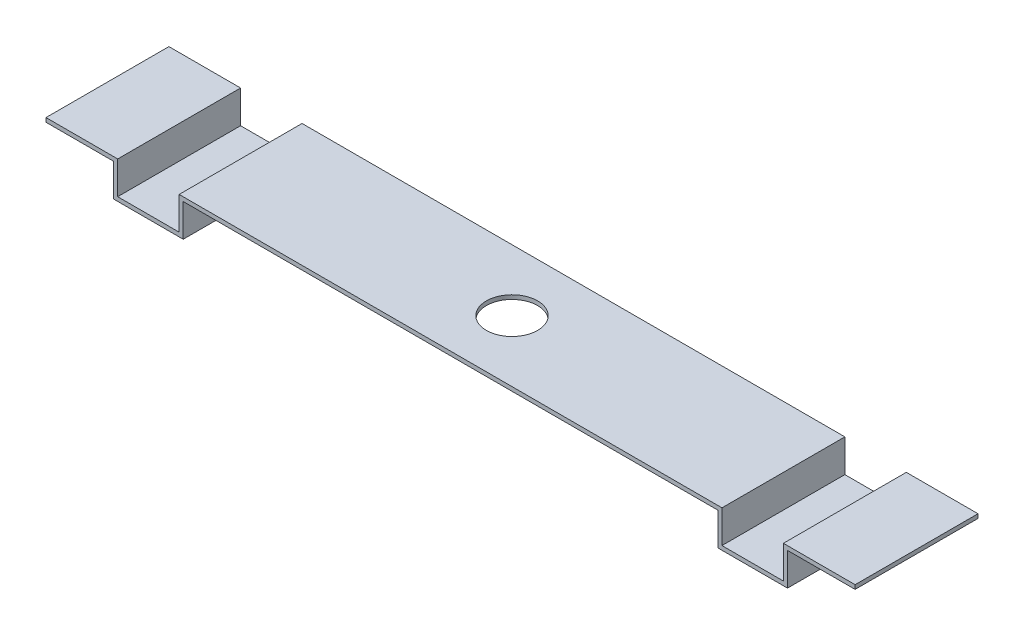
ISO-10303-21;
HEADER;
FILE_DESCRIPTION(('STEP AP214'),'2;1');
FILE_NAME('part.step','',(''),(''),'','','');
FILE_SCHEMA(('AUTOMOTIVE_DESIGN { 1 0 10303 214 1 1 1 1 }'));
ENDSEC;
DATA;
#1=APPLICATION_CONTEXT('core data for automotive mechanical design processes');
#2=APPLICATION_PROTOCOL_DEFINITION('international standard','automotive_design',2000,#1);
#3=PRODUCT_CONTEXT('',#1,'mechanical');
#4=PRODUCT('Part','Part','',(#3));
#5=PRODUCT_RELATED_PRODUCT_CATEGORY('part','',(#4));
#6=PRODUCT_DEFINITION_FORMATION('','',#4);
#7=PRODUCT_DEFINITION_CONTEXT('part definition',#1,'design');
#8=PRODUCT_DEFINITION('design','',#6,#7);
#9=PRODUCT_DEFINITION_SHAPE('','',#8);
#10=(LENGTH_UNIT() NAMED_UNIT(*) SI_UNIT(.MILLI.,.METRE.));
#11=(NAMED_UNIT(*) PLANE_ANGLE_UNIT() SI_UNIT($,.RADIAN.));
#12=(NAMED_UNIT(*) SI_UNIT($,.STERADIAN.) SOLID_ANGLE_UNIT());
#13=UNCERTAINTY_MEASURE_WITH_UNIT(LENGTH_MEASURE(1.E-05),#10,'distance_accuracy_value','');
#14=(GEOMETRIC_REPRESENTATION_CONTEXT(3) GLOBAL_UNCERTAINTY_ASSIGNED_CONTEXT((#13)) GLOBAL_UNIT_ASSIGNED_CONTEXT((#10,
#11,#12)) REPRESENTATION_CONTEXT('',''));
#15=CARTESIAN_POINT('',(0.,0.,0.));
#16=DIRECTION('',(0.,0.,1.));
#17=DIRECTION('',(1.,0.,0.));
#18=AXIS2_PLACEMENT_3D('',#15,#16,#17);
#19=CARTESIAN_POINT('',(305.142857142857,2.00000000000004,-60.));
#20=DIRECTION('',(1.,0.,0.));
#21=DIRECTION('',(0.,0.,-1.));
#22=AXIS2_PLACEMENT_3D('',#19,#20,#21);
#23=PLANE('',#22);
#24=DIRECTION('',(0.,1.,0.));
#25=VECTOR('',#24,1.);
#26=CARTESIAN_POINT('',(305.142857142857,2.00000000000004,0.));
#27=LINE('',#26,#25);
#28=CARTESIAN_POINT('',(305.142857142857,0.,0.));
#29=VERTEX_POINT('',#28);
#30=CARTESIAN_POINT('',(305.142857142857,2.00000000000004,0.));
#31=VERTEX_POINT('',#30);
#32=EDGE_CURVE('E215',#29,#31,#27,.T.);
#33=ORIENTED_EDGE('',*,*,#32,.F.);
#34=DIRECTION('',(0.,0.,1.));
#35=VECTOR('',#34,1.);
#36=CARTESIAN_POINT('',(305.142857142857,0.,-60.));
#37=LINE('',#36,#35);
#38=CARTESIAN_POINT('',(305.142857142857,0.,-60.));
#39=VERTEX_POINT('',#38);
#40=EDGE_CURVE('E11',#39,#29,#37,.T.);
#41=ORIENTED_EDGE('',*,*,#40,.F.);
#42=DIRECTION('',(0.,1.,0.));
#43=VECTOR('',#42,1.);
#44=CARTESIAN_POINT('',(305.142857142857,2.00000000000004,-60.));
#45=LINE('',#44,#43);
#46=CARTESIAN_POINT('',(305.142857142857,2.00000000000004,-60.));
#47=VERTEX_POINT('',#46);
#48=EDGE_CURVE('E291',#39,#47,#45,.T.);
#49=ORIENTED_EDGE('',*,*,#48,.T.);
#50=DIRECTION('',(0.,0.,1.));
#51=VECTOR('',#50,1.);
#52=CARTESIAN_POINT('',(305.142857142857,2.00000000000004,-60.));
#53=LINE('',#52,#51);
#54=EDGE_CURVE('E132',#47,#31,#53,.T.);
#55=ORIENTED_EDGE('',*,*,#54,.T.);
#56=EDGE_LOOP('',(#33,#41,#49,#55));
#57=FACE_BOUND('',#56,.T.);
#58=ADVANCED_FACE('F39',(#57),#23,.T.);
#59=CARTESIAN_POINT('',(305.142857142857,0.,-60.));
#60=DIRECTION('',(0.,-1.,0.));
#61=DIRECTION('',(1.,0.,0.));
#62=AXIS2_PLACEMENT_3D('',#59,#60,#61);
#63=PLANE('',#62);
#64=DIRECTION('',(1.,0.,0.));
#65=VECTOR('',#64,1.);
#66=CARTESIAN_POINT('',(305.142857142857,0.,0.));
#67=LINE('',#66,#65);
#68=CARTESIAN_POINT('',(272.142857142857,0.,0.));
#69=VERTEX_POINT('',#68);
#70=EDGE_CURVE('E288',#69,#29,#67,.T.);
#71=ORIENTED_EDGE('',*,*,#70,.F.);
#72=DIRECTION('',(0.,0.,1.));
#73=VECTOR('',#72,1.);
#74=CARTESIAN_POINT('',(272.142857142857,0.,-60.));
#75=LINE('',#74,#73);
#76=CARTESIAN_POINT('',(272.142857142857,0.,-60.));
#77=VERTEX_POINT('',#76);
#78=EDGE_CURVE('E49',#77,#69,#75,.T.);
#79=ORIENTED_EDGE('',*,*,#78,.F.);
#80=DIRECTION('',(1.,0.,0.));
#81=VECTOR('',#80,1.);
#82=CARTESIAN_POINT('',(305.142857142857,0.,-60.));
#83=LINE('',#82,#81);
#84=EDGE_CURVE('E201',#77,#39,#83,.T.);
#85=ORIENTED_EDGE('',*,*,#84,.T.);
#86=ORIENTED_EDGE('',*,*,#40,.T.);
#87=EDGE_LOOP('',(#71,#79,#85,#86));
#88=FACE_BOUND('',#87,.T.);
#89=ADVANCED_FACE('F346',(#88),#63,.T.);
#90=CARTESIAN_POINT('',(272.142857142857,0.,-60.));
#91=DIRECTION('',(1.,0.,0.));
#92=DIRECTION('',(0.,0.,-1.));
#93=AXIS2_PLACEMENT_3D('',#90,#91,#92);
#94=PLANE('',#93);
#95=DIRECTION('',(0.,1.,0.));
#96=VECTOR('',#95,1.);
#97=CARTESIAN_POINT('',(272.142857142857,0.,0.));
#98=LINE('',#97,#96);
#99=CARTESIAN_POINT('',(272.142857142857,-15.9642857142857,0.));
#100=VERTEX_POINT('',#99);
#101=EDGE_CURVE('E187',#100,#69,#98,.T.);
#102=ORIENTED_EDGE('',*,*,#101,.F.);
#103=DIRECTION('',(0.,0.,1.));
#104=VECTOR('',#103,1.);
#105=CARTESIAN_POINT('',(272.142857142857,-15.9642857142857,-60.));
#106=LINE('',#105,#104);
#107=CARTESIAN_POINT('',(272.142857142857,-15.9642857142857,-60.));
#108=VERTEX_POINT('',#107);
#109=EDGE_CURVE('E182',#108,#100,#106,.T.);
#110=ORIENTED_EDGE('',*,*,#109,.F.);
#111=DIRECTION('',(0.,1.,0.));
#112=VECTOR('',#111,1.);
#113=CARTESIAN_POINT('',(272.142857142857,0.,-60.));
#114=LINE('',#113,#112);
#115=EDGE_CURVE('E185',#108,#77,#114,.T.);
#116=ORIENTED_EDGE('',*,*,#115,.T.);
#117=ORIENTED_EDGE('',*,*,#78,.T.);
#118=EDGE_LOOP('',(#102,#110,#116,#117));
#119=FACE_BOUND('',#118,.T.);
#120=ADVANCED_FACE('F184',(#119),#94,.T.);
#121=CARTESIAN_POINT('',(272.142857142857,-15.9642857142857,-60.));
#122=DIRECTION('',(0.,-1.,0.));
#123=DIRECTION('',(1.,0.,0.));
#124=AXIS2_PLACEMENT_3D('',#121,#122,#123);
#125=PLANE('',#124);
#126=DIRECTION('',(1.,0.,0.));
#127=VECTOR('',#126,1.);
#128=CARTESIAN_POINT('',(272.142857142857,-15.9642857142857,0.));
#129=LINE('',#128,#127);
#130=CARTESIAN_POINT('',(238.142857142857,-15.9642857142857,0.));
#131=VERTEX_POINT('',#130);
#132=EDGE_CURVE('E283',#131,#100,#129,.T.);
#133=ORIENTED_EDGE('',*,*,#132,.F.);
#134=DIRECTION('',(0.,0.,1.));
#135=VECTOR('',#134,1.);
#136=CARTESIAN_POINT('',(238.142857142857,-15.9642857142857,-60.));
#137=LINE('',#136,#135);
#138=CARTESIAN_POINT('',(238.142857142857,-15.9642857142857,-60.));
#139=VERTEX_POINT('',#138);
#140=EDGE_CURVE('E193',#139,#131,#137,.T.);
#141=ORIENTED_EDGE('',*,*,#140,.F.);
#142=DIRECTION('',(1.,0.,0.));
#143=VECTOR('',#142,1.);
#144=CARTESIAN_POINT('',(272.142857142857,-15.9642857142857,-60.));
#145=LINE('',#144,#143);
#146=EDGE_CURVE('E199',#139,#108,#145,.T.);
#147=ORIENTED_EDGE('',*,*,#146,.T.);
#148=ORIENTED_EDGE('',*,*,#109,.T.);
#149=EDGE_LOOP('',(#133,#141,#147,#148));
#150=FACE_BOUND('',#149,.T.);
#151=ADVANCED_FACE('F204',(#150),#125,.T.);
#152=CARTESIAN_POINT('',(238.142857142857,-15.9642857142857,-60.));
#153=DIRECTION('',(-1.,0.,0.));
#154=DIRECTION('',(0.,0.,1.));
#155=AXIS2_PLACEMENT_3D('',#152,#153,#154);
#156=PLANE('',#155);
#157=DIRECTION('',(0.,-1.,0.));
#158=VECTOR('',#157,1.);
#159=CARTESIAN_POINT('',(238.142857142857,-15.9642857142857,0.));
#160=LINE('',#159,#158);
#161=CARTESIAN_POINT('',(238.142857142857,0.,0.));
#162=VERTEX_POINT('',#161);
#163=EDGE_CURVE('E279',#162,#131,#160,.T.);
#164=ORIENTED_EDGE('',*,*,#163,.F.);
#165=DIRECTION('',(0.,0.,1.));
#166=VECTOR('',#165,1.);
#167=CARTESIAN_POINT('',(238.142857142857,0.,-60.));
#168=LINE('',#167,#166);
#169=CARTESIAN_POINT('',(238.142857142857,0.,-60.));
#170=VERTEX_POINT('',#169);
#171=EDGE_CURVE('E297',#170,#162,#168,.T.);
#172=ORIENTED_EDGE('',*,*,#171,.F.);
#173=DIRECTION('',(0.,-1.,0.));
#174=VECTOR('',#173,1.);
#175=CARTESIAN_POINT('',(238.142857142857,-15.9642857142857,-60.));
#176=LINE('',#175,#174);
#177=EDGE_CURVE('E206',#170,#139,#176,.T.);
#178=ORIENTED_EDGE('',*,*,#177,.T.);
#179=ORIENTED_EDGE('',*,*,#140,.T.);
#180=EDGE_LOOP('',(#164,#172,#178,#179));
#181=FACE_BOUND('',#180,.T.);
#182=ADVANCED_FACE('F359',(#181),#156,.T.);
#183=CARTESIAN_POINT('',(238.142857142857,0.,-60.));
#184=DIRECTION('',(0.,-1.,0.));
#185=DIRECTION('',(1.,0.,0.));
#186=AXIS2_PLACEMENT_3D('',#183,#184,#185);
#187=PLANE('',#186);
#188=CARTESIAN_POINT('',(107.642857142857,0.,-30.));
#189=DIRECTION('',(0.,1.,0.));
#190=DIRECTION('',(0.,0.,1.));
#191=AXIS2_PLACEMENT_3D('',#188,#189,#190);
#192=CIRCLE('',#191,12.5);
#193=CARTESIAN_POINT('',(107.642857142857,0.,-17.5));
#194=VERTEX_POINT('',#193);
#195=EDGE_CURVE('E436',#194,#194,#192,.T.);
#196=ORIENTED_EDGE('',*,*,#195,.T.);
#197=EDGE_LOOP('',(#196));
#198=FACE_BOUND('',#197,.T.);
#199=DIRECTION('',(1.,0.,0.));
#200=VECTOR('',#199,1.);
#201=CARTESIAN_POINT('',(238.142857142857,0.,0.));
#202=LINE('',#201,#200);
#203=CARTESIAN_POINT('',(-22.8571428571429,0.,0.));
#204=VERTEX_POINT('',#203);
#205=EDGE_CURVE('E275',#204,#162,#202,.T.);
#206=ORIENTED_EDGE('',*,*,#205,.F.);
#207=DIRECTION('',(0.,0.,1.));
#208=VECTOR('',#207,1.);
#209=CARTESIAN_POINT('',(-22.8571428571429,0.,-60.));
#210=LINE('',#209,#208);
#211=CARTESIAN_POINT('',(-22.8571428571429,0.,-60.));
#212=VERTEX_POINT('',#211);
#213=EDGE_CURVE('E300',#212,#204,#210,.T.);
#214=ORIENTED_EDGE('',*,*,#213,.F.);
#215=DIRECTION('',(1.,0.,0.));
#216=VECTOR('',#215,1.);
#217=CARTESIAN_POINT('',(238.142857142857,0.,-60.));
#218=LINE('',#217,#216);
#219=EDGE_CURVE('E209',#212,#170,#218,.T.);
#220=ORIENTED_EDGE('',*,*,#219,.T.);
#221=ORIENTED_EDGE('',*,*,#171,.T.);
#222=EDGE_LOOP('',(#206,#214,#220,#221));
#223=FACE_BOUND('',#222,.T.);
#224=ADVANCED_FACE('F362',(#198,#223),#187,.T.);
#225=CARTESIAN_POINT('',(-22.8571428571429,0.,-60.));
#226=DIRECTION('',(1.,0.,0.));
#227=DIRECTION('',(0.,1.,0.));
#228=AXIS2_PLACEMENT_3D('',#225,#226,#227);
#229=PLANE('',#228);
#230=DIRECTION('',(0.,1.,0.));
#231=VECTOR('',#230,1.);
#232=CARTESIAN_POINT('',(-22.8571428571429,0.,0.));
#233=LINE('',#232,#231);
#234=CARTESIAN_POINT('',(-22.8571428571428,-15.9642857142857,0.));
#235=VERTEX_POINT('',#234);
#236=EDGE_CURVE('E271',#235,#204,#233,.T.);
#237=ORIENTED_EDGE('',*,*,#236,.F.);
#238=DIRECTION('',(0.,0.,1.));
#239=VECTOR('',#238,1.);
#240=CARTESIAN_POINT('',(-22.8571428571428,-15.9642857142857,-60.));
#241=LINE('',#240,#239);
#242=CARTESIAN_POINT('',(-22.8571428571428,-15.9642857142857,-60.));
#243=VERTEX_POINT('',#242);
#244=EDGE_CURVE('E303',#243,#235,#241,.T.);
#245=ORIENTED_EDGE('',*,*,#244,.F.);
#246=DIRECTION('',(0.,1.,0.));
#247=VECTOR('',#246,1.);
#248=CARTESIAN_POINT('',(-22.8571428571429,0.,-60.));
#249=LINE('',#248,#247);
#250=EDGE_CURVE('E494',#243,#212,#249,.T.);
#251=ORIENTED_EDGE('',*,*,#250,.T.);
#252=ORIENTED_EDGE('',*,*,#213,.T.);
#253=EDGE_LOOP('',(#237,#245,#251,#252));
#254=FACE_BOUND('',#253,.T.);
#255=ADVANCED_FACE('F366',(#254),#229,.T.);
#256=CARTESIAN_POINT('',(-22.8571428571428,-15.9642857142857,-60.));
#257=DIRECTION('',(0.,-1.,0.));
#258=DIRECTION('',(0.,0.,-1.));
#259=AXIS2_PLACEMENT_3D('',#256,#257,#258);
#260=PLANE('',#259);
#261=DIRECTION('',(1.,0.,0.));
#262=VECTOR('',#261,1.);
#263=CARTESIAN_POINT('',(-22.8571428571428,-15.9642857142857,0.));
#264=LINE('',#263,#262);
#265=CARTESIAN_POINT('',(-56.8571428571428,-15.9642857142857,0.));
#266=VERTEX_POINT('',#265);
#267=EDGE_CURVE('E267',#266,#235,#264,.T.);
#268=ORIENTED_EDGE('',*,*,#267,.F.);
#269=DIRECTION('',(0.,0.,1.));
#270=VECTOR('',#269,1.);
#271=CARTESIAN_POINT('',(-56.8571428571428,-15.9642857142857,-60.));
#272=LINE('',#271,#270);
#273=CARTESIAN_POINT('',(-56.8571428571428,-15.9642857142857,-60.));
#274=VERTEX_POINT('',#273);
#275=EDGE_CURVE('E306',#274,#266,#272,.T.);
#276=ORIENTED_EDGE('',*,*,#275,.F.);
#277=DIRECTION('',(1.,0.,0.));
#278=VECTOR('',#277,1.);
#279=CARTESIAN_POINT('',(-22.8571428571428,-15.9642857142857,-60.));
#280=LINE('',#279,#278);
#281=EDGE_CURVE('E490',#274,#243,#280,.T.);
#282=ORIENTED_EDGE('',*,*,#281,.T.);
#283=ORIENTED_EDGE('',*,*,#244,.T.);
#284=EDGE_LOOP('',(#268,#276,#282,#283));
#285=FACE_BOUND('',#284,.T.);
#286=ADVANCED_FACE('F370',(#285),#260,.T.);
#287=CARTESIAN_POINT('',(-56.8571428571428,-15.9642857142857,-60.));
#288=DIRECTION('',(-1.,0.,0.));
#289=DIRECTION('',(0.,0.,1.));
#290=AXIS2_PLACEMENT_3D('',#287,#288,#289);
#291=PLANE('',#290);
#292=DIRECTION('',(0.,-1.,0.));
#293=VECTOR('',#292,1.);
#294=CARTESIAN_POINT('',(-56.8571428571428,-15.9642857142857,0.));
#295=LINE('',#294,#293);
#296=CARTESIAN_POINT('',(-56.8571428571428,0.,0.));
#297=VERTEX_POINT('',#296);
#298=EDGE_CURVE('E263',#297,#266,#295,.T.);
#299=ORIENTED_EDGE('',*,*,#298,.F.);
#300=DIRECTION('',(0.,0.,1.));
#301=VECTOR('',#300,1.);
#302=CARTESIAN_POINT('',(-56.8571428571428,0.,-60.));
#303=LINE('',#302,#301);
#304=CARTESIAN_POINT('',(-56.8571428571428,0.,-60.));
#305=VERTEX_POINT('',#304);
#306=EDGE_CURVE('E309',#305,#297,#303,.T.);
#307=ORIENTED_EDGE('',*,*,#306,.F.);
#308=DIRECTION('',(0.,-1.,0.));
#309=VECTOR('',#308,1.);
#310=CARTESIAN_POINT('',(-56.8571428571428,-15.9642857142857,-60.));
#311=LINE('',#310,#309);
#312=EDGE_CURVE('E486',#305,#274,#311,.T.);
#313=ORIENTED_EDGE('',*,*,#312,.T.);
#314=ORIENTED_EDGE('',*,*,#275,.T.);
#315=EDGE_LOOP('',(#299,#307,#313,#314));
#316=FACE_BOUND('',#315,.T.);
#317=ADVANCED_FACE('F374',(#316),#291,.T.);
#318=CARTESIAN_POINT('',(-56.8571428571428,0.,-60.));
#319=DIRECTION('',(0.,-1.,0.));
#320=DIRECTION('',(1.,0.,0.));
#321=AXIS2_PLACEMENT_3D('',#318,#319,#320);
#322=PLANE('',#321);
#323=DIRECTION('',(1.,0.,0.));
#324=VECTOR('',#323,1.);
#325=CARTESIAN_POINT('',(-56.8571428571428,0.,0.));
#326=LINE('',#325,#324);
#327=CARTESIAN_POINT('',(-89.8571428571428,0.,0.));
#328=VERTEX_POINT('',#327);
#329=EDGE_CURVE('E259',#328,#297,#326,.T.);
#330=ORIENTED_EDGE('',*,*,#329,.F.);
#331=DIRECTION('',(0.,0.,1.));
#332=VECTOR('',#331,1.);
#333=CARTESIAN_POINT('',(-89.8571428571428,0.,-60.));
#334=LINE('',#333,#332);
#335=CARTESIAN_POINT('',(-89.8571428571428,0.,-60.));
#336=VERTEX_POINT('',#335);
#337=EDGE_CURVE('E312',#336,#328,#334,.T.);
#338=ORIENTED_EDGE('',*,*,#337,.F.);
#339=DIRECTION('',(1.,0.,0.));
#340=VECTOR('',#339,1.);
#341=CARTESIAN_POINT('',(-56.8571428571428,0.,-60.));
#342=LINE('',#341,#340);
#343=EDGE_CURVE('E482',#336,#305,#342,.T.);
#344=ORIENTED_EDGE('',*,*,#343,.T.);
#345=ORIENTED_EDGE('',*,*,#306,.T.);
#346=EDGE_LOOP('',(#330,#338,#344,#345));
#347=FACE_BOUND('',#346,.T.);
#348=ADVANCED_FACE('F378',(#347),#322,.T.);
#349=CARTESIAN_POINT('',(-89.8571428571428,2.,-60.));
#350=DIRECTION('',(-1.,0.,0.));
#351=DIRECTION('',(0.,-1.,0.));
#352=AXIS2_PLACEMENT_3D('',#349,#350,#351);
#353=PLANE('',#352);
#354=DIRECTION('',(0.,-1.,0.));
#355=VECTOR('',#354,1.);
#356=CARTESIAN_POINT('',(-89.8571428571428,2.,0.));
#357=LINE('',#356,#355);
#358=CARTESIAN_POINT('',(-89.8571428571428,2.,0.));
#359=VERTEX_POINT('',#358);
#360=EDGE_CURVE('E255',#359,#328,#357,.T.);
#361=ORIENTED_EDGE('',*,*,#360,.F.);
#362=DIRECTION('',(0.,0.,1.));
#363=VECTOR('',#362,1.);
#364=CARTESIAN_POINT('',(-89.8571428571428,2.,-60.));
#365=LINE('',#364,#363);
#366=CARTESIAN_POINT('',(-89.8571428571428,2.,-60.));
#367=VERTEX_POINT('',#366);
#368=EDGE_CURVE('E315',#367,#359,#365,.T.);
#369=ORIENTED_EDGE('',*,*,#368,.F.);
#370=DIRECTION('',(0.,-1.,0.));
#371=VECTOR('',#370,1.);
#372=CARTESIAN_POINT('',(-89.8571428571428,2.,-60.));
#373=LINE('',#372,#371);
#374=EDGE_CURVE('E478',#367,#336,#373,.T.);
#375=ORIENTED_EDGE('',*,*,#374,.T.);
#376=ORIENTED_EDGE('',*,*,#337,.T.);
#377=EDGE_LOOP('',(#361,#369,#375,#376));
#378=FACE_BOUND('',#377,.T.);
#379=ADVANCED_FACE('F382',(#378),#353,.T.);
#380=CARTESIAN_POINT('',(-89.8571428571428,2.,-60.));
#381=DIRECTION('',(0.,1.,0.));
#382=DIRECTION('',(0.,0.,1.));
#383=AXIS2_PLACEMENT_3D('',#380,#381,#382);
#384=PLANE('',#383);
#385=DIRECTION('',(-1.,0.,0.));
#386=VECTOR('',#385,1.);
#387=CARTESIAN_POINT('',(-89.8571428571428,2.,0.));
#388=LINE('',#387,#386);
#389=CARTESIAN_POINT('',(-54.8571428571428,2.,0.));
#390=VERTEX_POINT('',#389);
#391=EDGE_CURVE('E251',#390,#359,#388,.T.);
#392=ORIENTED_EDGE('',*,*,#391,.F.);
#393=DIRECTION('',(0.,0.,1.));
#394=VECTOR('',#393,1.);
#395=CARTESIAN_POINT('',(-54.8571428571428,2.,-60.));
#396=LINE('',#395,#394);
#397=CARTESIAN_POINT('',(-54.8571428571428,2.,-60.));
#398=VERTEX_POINT('',#397);
#399=EDGE_CURVE('E318',#398,#390,#396,.T.);
#400=ORIENTED_EDGE('',*,*,#399,.F.);
#401=DIRECTION('',(-1.,0.,0.));
#402=VECTOR('',#401,1.);
#403=CARTESIAN_POINT('',(-89.8571428571428,2.,-60.));
#404=LINE('',#403,#402);
#405=EDGE_CURVE('E474',#398,#367,#404,.T.);
#406=ORIENTED_EDGE('',*,*,#405,.T.);
#407=ORIENTED_EDGE('',*,*,#368,.T.);
#408=EDGE_LOOP('',(#392,#400,#406,#407));
#409=FACE_BOUND('',#408,.T.);
#410=ADVANCED_FACE('F386',(#409),#384,.T.);
#411=CARTESIAN_POINT('',(-54.8571428571428,2.,-60.));
#412=DIRECTION('',(1.,0.,0.));
#413=DIRECTION('',(0.,0.,-1.));
#414=AXIS2_PLACEMENT_3D('',#411,#412,#413);
#415=PLANE('',#414);
#416=DIRECTION('',(0.,1.,0.));
#417=VECTOR('',#416,1.);
#418=CARTESIAN_POINT('',(-54.8571428571428,2.,0.));
#419=LINE('',#418,#417);
#420=CARTESIAN_POINT('',(-54.8571428571428,-13.9642857142857,0.));
#421=VERTEX_POINT('',#420);
#422=EDGE_CURVE('E247',#421,#390,#419,.T.);
#423=ORIENTED_EDGE('',*,*,#422,.F.);
#424=DIRECTION('',(0.,0.,1.));
#425=VECTOR('',#424,1.);
#426=CARTESIAN_POINT('',(-54.8571428571428,-13.9642857142857,-60.));
#427=LINE('',#426,#425);
#428=CARTESIAN_POINT('',(-54.8571428571428,-13.9642857142857,-60.));
#429=VERTEX_POINT('',#428);
#430=EDGE_CURVE('E321',#429,#421,#427,.T.);
#431=ORIENTED_EDGE('',*,*,#430,.F.);
#432=DIRECTION('',(0.,1.,0.));
#433=VECTOR('',#432,1.);
#434=CARTESIAN_POINT('',(-54.8571428571428,2.,-60.));
#435=LINE('',#434,#433);
#436=EDGE_CURVE('E470',#429,#398,#435,.T.);
#437=ORIENTED_EDGE('',*,*,#436,.T.);
#438=ORIENTED_EDGE('',*,*,#399,.T.);
#439=EDGE_LOOP('',(#423,#431,#437,#438));
#440=FACE_BOUND('',#439,.T.);
#441=ADVANCED_FACE('F390',(#440),#415,.T.);
#442=CARTESIAN_POINT('',(-54.8571428571428,-13.9642857142857,-60.));
#443=DIRECTION('',(0.,1.,0.));
#444=DIRECTION('',(-1.,0.,0.));
#445=AXIS2_PLACEMENT_3D('',#442,#443,#444);
#446=PLANE('',#445);
#447=DIRECTION('',(-1.,0.,0.));
#448=VECTOR('',#447,1.);
#449=CARTESIAN_POINT('',(-54.8571428571428,-13.9642857142857,0.));
#450=LINE('',#449,#448);
#451=CARTESIAN_POINT('',(-24.8571428571428,-13.9642857142857,0.));
#452=VERTEX_POINT('',#451);
#453=EDGE_CURVE('E243',#452,#421,#450,.T.);
#454=ORIENTED_EDGE('',*,*,#453,.F.);
#455=DIRECTION('',(0.,0.,1.));
#456=VECTOR('',#455,1.);
#457=CARTESIAN_POINT('',(-24.8571428571428,-13.9642857142857,-60.));
#458=LINE('',#457,#456);
#459=CARTESIAN_POINT('',(-24.8571428571428,-13.9642857142857,-60.));
#460=VERTEX_POINT('',#459);
#461=EDGE_CURVE('E324',#460,#452,#458,.T.);
#462=ORIENTED_EDGE('',*,*,#461,.F.);
#463=DIRECTION('',(-1.,0.,0.));
#464=VECTOR('',#463,1.);
#465=CARTESIAN_POINT('',(-54.8571428571428,-13.9642857142857,-60.));
#466=LINE('',#465,#464);
#467=EDGE_CURVE('E466',#460,#429,#466,.T.);
#468=ORIENTED_EDGE('',*,*,#467,.T.);
#469=ORIENTED_EDGE('',*,*,#430,.T.);
#470=EDGE_LOOP('',(#454,#462,#468,#469));
#471=FACE_BOUND('',#470,.T.);
#472=ADVANCED_FACE('F394',(#471),#446,.T.);
#473=CARTESIAN_POINT('',(-24.8571428571428,-13.9642857142857,-60.));
#474=DIRECTION('',(-1.,0.,0.));
#475=DIRECTION('',(0.,-1.,0.));
#476=AXIS2_PLACEMENT_3D('',#473,#474,#475);
#477=PLANE('',#476);
#478=DIRECTION('',(0.,-1.,0.));
#479=VECTOR('',#478,1.);
#480=CARTESIAN_POINT('',(-24.8571428571428,-13.9642857142857,0.));
#481=LINE('',#480,#479);
#482=CARTESIAN_POINT('',(-24.8571428571428,1.99999999999999,0.));
#483=VERTEX_POINT('',#482);
#484=EDGE_CURVE('E239',#483,#452,#481,.T.);
#485=ORIENTED_EDGE('',*,*,#484,.F.);
#486=DIRECTION('',(0.,0.,1.));
#487=VECTOR('',#486,1.);
#488=CARTESIAN_POINT('',(-24.8571428571428,1.99999999999999,-60.));
#489=LINE('',#488,#487);
#490=CARTESIAN_POINT('',(-24.8571428571428,1.99999999999999,-60.));
#491=VERTEX_POINT('',#490);
#492=EDGE_CURVE('E327',#491,#483,#489,.T.);
#493=ORIENTED_EDGE('',*,*,#492,.F.);
#494=DIRECTION('',(0.,-1.,0.));
#495=VECTOR('',#494,1.);
#496=CARTESIAN_POINT('',(-24.8571428571428,-13.9642857142857,-60.));
#497=LINE('',#496,#495);
#498=EDGE_CURVE('E462',#491,#460,#497,.T.);
#499=ORIENTED_EDGE('',*,*,#498,.T.);
#500=ORIENTED_EDGE('',*,*,#461,.T.);
#501=EDGE_LOOP('',(#485,#493,#499,#500));
#502=FACE_BOUND('',#501,.T.);
#503=ADVANCED_FACE('F398',(#502),#477,.T.);
#504=CARTESIAN_POINT('',(-24.8571428571428,1.99999999999999,-60.));
#505=DIRECTION('',(0.,1.,0.));
#506=DIRECTION('',(0.,0.,1.));
#507=AXIS2_PLACEMENT_3D('',#504,#505,#506);
#508=PLANE('',#507);
#509=CARTESIAN_POINT('',(107.642857142857,1.99999999999999,-30.));
#510=DIRECTION('',(0.,1.,0.));
#511=DIRECTION('',(0.,0.,1.));
#512=AXIS2_PLACEMENT_3D('',#509,#510,#511);
#513=CIRCLE('',#512,12.5);
#514=CARTESIAN_POINT('',(107.642857142857,1.99999999999999,-17.5));
#515=VERTEX_POINT('',#514);
#516=EDGE_CURVE('E42',#515,#515,#513,.F.);
#517=ORIENTED_EDGE('',*,*,#516,.T.);
#518=EDGE_LOOP('',(#517));
#519=FACE_BOUND('',#518,.T.);
#520=DIRECTION('',(-1.,0.,0.));
#521=VECTOR('',#520,1.);
#522=CARTESIAN_POINT('',(-24.8571428571428,1.99999999999999,0.));
#523=LINE('',#522,#521);
#524=CARTESIAN_POINT('',(240.142857142857,1.99999999999999,0.));
#525=VERTEX_POINT('',#524);
#526=EDGE_CURVE('E235',#525,#483,#523,.T.);
#527=ORIENTED_EDGE('',*,*,#526,.F.);
#528=DIRECTION('',(0.,0.,1.));
#529=VECTOR('',#528,1.);
#530=CARTESIAN_POINT('',(240.142857142857,1.99999999999999,-60.));
#531=LINE('',#530,#529);
#532=CARTESIAN_POINT('',(240.142857142857,1.99999999999999,-60.));
#533=VERTEX_POINT('',#532);
#534=EDGE_CURVE('E330',#533,#525,#531,.T.);
#535=ORIENTED_EDGE('',*,*,#534,.F.);
#536=DIRECTION('',(-1.,0.,0.));
#537=VECTOR('',#536,1.);
#538=CARTESIAN_POINT('',(-24.8571428571428,1.99999999999999,-60.));
#539=LINE('',#538,#537);
#540=EDGE_CURVE('E458',#533,#491,#539,.T.);
#541=ORIENTED_EDGE('',*,*,#540,.T.);
#542=ORIENTED_EDGE('',*,*,#492,.T.);
#543=EDGE_LOOP('',(#527,#535,#541,#542));
#544=FACE_BOUND('',#543,.T.);
#545=ADVANCED_FACE('F402',(#519,#544),#508,.T.);
#546=CARTESIAN_POINT('',(240.142857142857,1.99999999999999,-60.));
#547=DIRECTION('',(1.,0.,0.));
#548=DIRECTION('',(0.,0.,-1.));
#549=AXIS2_PLACEMENT_3D('',#546,#547,#548);
#550=PLANE('',#549);
#551=DIRECTION('',(0.,1.,0.));
#552=VECTOR('',#551,1.);
#553=CARTESIAN_POINT('',(240.142857142857,1.99999999999999,0.));
#554=LINE('',#553,#552);
#555=CARTESIAN_POINT('',(240.142857142857,-13.9642857142857,0.));
#556=VERTEX_POINT('',#555);
#557=EDGE_CURVE('E231',#556,#525,#554,.T.);
#558=ORIENTED_EDGE('',*,*,#557,.F.);
#559=DIRECTION('',(0.,0.,1.));
#560=VECTOR('',#559,1.);
#561=CARTESIAN_POINT('',(240.142857142857,-13.9642857142857,-60.));
#562=LINE('',#561,#560);
#563=CARTESIAN_POINT('',(240.142857142857,-13.9642857142857,-60.));
#564=VERTEX_POINT('',#563);
#565=EDGE_CURVE('E333',#564,#556,#562,.T.);
#566=ORIENTED_EDGE('',*,*,#565,.F.);
#567=DIRECTION('',(0.,1.,0.));
#568=VECTOR('',#567,1.);
#569=CARTESIAN_POINT('',(240.142857142857,1.99999999999999,-60.));
#570=LINE('',#569,#568);
#571=EDGE_CURVE('E454',#564,#533,#570,.T.);
#572=ORIENTED_EDGE('',*,*,#571,.T.);
#573=ORIENTED_EDGE('',*,*,#534,.T.);
#574=EDGE_LOOP('',(#558,#566,#572,#573));
#575=FACE_BOUND('',#574,.T.);
#576=ADVANCED_FACE('F406',(#575),#550,.T.);
#577=CARTESIAN_POINT('',(240.142857142857,-13.9642857142857,-60.));
#578=DIRECTION('',(0.,1.,0.));
#579=DIRECTION('',(-1.,0.,0.));
#580=AXIS2_PLACEMENT_3D('',#577,#578,#579);
#581=PLANE('',#580);
#582=DIRECTION('',(-1.,0.,0.));
#583=VECTOR('',#582,1.);
#584=CARTESIAN_POINT('',(240.142857142857,-13.9642857142857,0.));
#585=LINE('',#584,#583);
#586=CARTESIAN_POINT('',(270.142857142857,-13.9642857142857,0.));
#587=VERTEX_POINT('',#586);
#588=EDGE_CURVE('E227',#587,#556,#585,.T.);
#589=ORIENTED_EDGE('',*,*,#588,.F.);
#590=DIRECTION('',(0.,0.,1.));
#591=VECTOR('',#590,1.);
#592=CARTESIAN_POINT('',(270.142857142857,-13.9642857142857,-60.));
#593=LINE('',#592,#591);
#594=CARTESIAN_POINT('',(270.142857142857,-13.9642857142857,-60.));
#595=VERTEX_POINT('',#594);
#596=EDGE_CURVE('E336',#595,#587,#593,.T.);
#597=ORIENTED_EDGE('',*,*,#596,.F.);
#598=DIRECTION('',(-1.,0.,0.));
#599=VECTOR('',#598,1.);
#600=CARTESIAN_POINT('',(240.142857142857,-13.9642857142857,-60.));
#601=LINE('',#600,#599);
#602=EDGE_CURVE('E450',#595,#564,#601,.T.);
#603=ORIENTED_EDGE('',*,*,#602,.T.);
#604=ORIENTED_EDGE('',*,*,#565,.T.);
#605=EDGE_LOOP('',(#589,#597,#603,#604));
#606=FACE_BOUND('',#605,.T.);
#607=ADVANCED_FACE('F410',(#606),#581,.T.);
#608=CARTESIAN_POINT('',(270.142857142857,-13.9642857142857,-60.));
#609=DIRECTION('',(-1.,0.,0.));
#610=DIRECTION('',(0.,0.,1.));
#611=AXIS2_PLACEMENT_3D('',#608,#609,#610);
#612=PLANE('',#611);
#613=DIRECTION('',(0.,-1.,0.));
#614=VECTOR('',#613,1.);
#615=CARTESIAN_POINT('',(270.142857142857,-13.9642857142857,0.));
#616=LINE('',#615,#614);
#617=CARTESIAN_POINT('',(270.142857142857,2.00000000000004,0.));
#618=VERTEX_POINT('',#617);
#619=EDGE_CURVE('E223',#618,#587,#616,.T.);
#620=ORIENTED_EDGE('',*,*,#619,.F.);
#621=DIRECTION('',(0.,0.,1.));
#622=VECTOR('',#621,1.);
#623=CARTESIAN_POINT('',(270.142857142857,2.00000000000004,-60.));
#624=LINE('',#623,#622);
#625=CARTESIAN_POINT('',(270.142857142857,2.00000000000004,-60.));
#626=VERTEX_POINT('',#625);
#627=EDGE_CURVE('E339',#626,#618,#624,.T.);
#628=ORIENTED_EDGE('',*,*,#627,.F.);
#629=DIRECTION('',(0.,-1.,0.));
#630=VECTOR('',#629,1.);
#631=CARTESIAN_POINT('',(270.142857142857,-13.9642857142857,-60.));
#632=LINE('',#631,#630);
#633=EDGE_CURVE('E446',#626,#595,#632,.T.);
#634=ORIENTED_EDGE('',*,*,#633,.T.);
#635=ORIENTED_EDGE('',*,*,#596,.T.);
#636=EDGE_LOOP('',(#620,#628,#634,#635));
#637=FACE_BOUND('',#636,.T.);
#638=ADVANCED_FACE('F414',(#637),#612,.T.);
#639=CARTESIAN_POINT('',(270.142857142857,2.00000000000004,-60.));
#640=DIRECTION('',(0.,1.,0.));
#641=DIRECTION('',(-1.,0.,0.));
#642=AXIS2_PLACEMENT_3D('',#639,#640,#641);
#643=PLANE('',#642);
#644=DIRECTION('',(-1.,0.,0.));
#645=VECTOR('',#644,1.);
#646=CARTESIAN_POINT('',(270.142857142857,2.00000000000004,0.));
#647=LINE('',#646,#645);
#648=EDGE_CURVE('E219',#31,#618,#647,.T.);
#649=ORIENTED_EDGE('',*,*,#648,.F.);
#650=ORIENTED_EDGE('',*,*,#54,.F.);
#651=DIRECTION('',(-1.,0.,0.));
#652=VECTOR('',#651,1.);
#653=CARTESIAN_POINT('',(270.142857142857,2.00000000000004,-60.));
#654=LINE('',#653,#652);
#655=EDGE_CURVE('E443',#47,#626,#654,.T.);
#656=ORIENTED_EDGE('',*,*,#655,.T.);
#657=ORIENTED_EDGE('',*,*,#627,.T.);
#658=EDGE_LOOP('',(#649,#650,#656,#657));
#659=FACE_BOUND('',#658,.T.);
#660=ADVANCED_FACE('F342',(#659),#643,.T.);
#661=CARTESIAN_POINT('',(0.,0.,-60.));
#662=DIRECTION('',(0.,0.,-1.));
#663=DIRECTION('',(-1.,0.,0.));
#664=AXIS2_PLACEMENT_3D('',#661,#662,#663);
#665=PLANE('',#664);
#666=ORIENTED_EDGE('',*,*,#48,.F.);
#667=ORIENTED_EDGE('',*,*,#84,.F.);
#668=ORIENTED_EDGE('',*,*,#115,.F.);
#669=ORIENTED_EDGE('',*,*,#146,.F.);
#670=ORIENTED_EDGE('',*,*,#177,.F.);
#671=ORIENTED_EDGE('',*,*,#219,.F.);
#672=ORIENTED_EDGE('',*,*,#250,.F.);
#673=ORIENTED_EDGE('',*,*,#281,.F.);
#674=ORIENTED_EDGE('',*,*,#312,.F.);
#675=ORIENTED_EDGE('',*,*,#343,.F.);
#676=ORIENTED_EDGE('',*,*,#374,.F.);
#677=ORIENTED_EDGE('',*,*,#405,.F.);
#678=ORIENTED_EDGE('',*,*,#436,.F.);
#679=ORIENTED_EDGE('',*,*,#467,.F.);
#680=ORIENTED_EDGE('',*,*,#498,.F.);
#681=ORIENTED_EDGE('',*,*,#540,.F.);
#682=ORIENTED_EDGE('',*,*,#571,.F.);
#683=ORIENTED_EDGE('',*,*,#602,.F.);
#684=ORIENTED_EDGE('',*,*,#633,.F.);
#685=ORIENTED_EDGE('',*,*,#655,.F.);
#686=EDGE_LOOP('',(#666,#667,#668,#669,#670,#671,#672,#673,#674,#675,#676,#677,#678,#679,#680,
#681,#682,#683,#684,#685));
#687=FACE_BOUND('',#686,.T.);
#688=ADVANCED_FACE('F197',(#687),#665,.T.);
#689=CARTESIAN_POINT('',(0.,0.,0.));
#690=DIRECTION('',(0.,0.,-1.));
#691=DIRECTION('',(-1.,0.,0.));
#692=AXIS2_PLACEMENT_3D('',#689,#690,#691);
#693=PLANE('',#692);
#694=ORIENTED_EDGE('',*,*,#32,.T.);
#695=ORIENTED_EDGE('',*,*,#648,.T.);
#696=ORIENTED_EDGE('',*,*,#619,.T.);
#697=ORIENTED_EDGE('',*,*,#588,.T.);
#698=ORIENTED_EDGE('',*,*,#557,.T.);
#699=ORIENTED_EDGE('',*,*,#526,.T.);
#700=ORIENTED_EDGE('',*,*,#484,.T.);
#701=ORIENTED_EDGE('',*,*,#453,.T.);
#702=ORIENTED_EDGE('',*,*,#422,.T.);
#703=ORIENTED_EDGE('',*,*,#391,.T.);
#704=ORIENTED_EDGE('',*,*,#360,.T.);
#705=ORIENTED_EDGE('',*,*,#329,.T.);
#706=ORIENTED_EDGE('',*,*,#298,.T.);
#707=ORIENTED_EDGE('',*,*,#267,.T.);
#708=ORIENTED_EDGE('',*,*,#236,.T.);
#709=ORIENTED_EDGE('',*,*,#205,.T.);
#710=ORIENTED_EDGE('',*,*,#163,.T.);
#711=ORIENTED_EDGE('',*,*,#132,.T.);
#712=ORIENTED_EDGE('',*,*,#101,.T.);
#713=ORIENTED_EDGE('',*,*,#70,.T.);
#714=EDGE_LOOP('',(#694,#695,#696,#697,#698,#699,#700,#701,#702,#703,#704,#705,#706,#707,#708,
#709,#710,#711,#712,#713));
#715=FACE_BOUND('',#714,.T.);
#716=ADVANCED_FACE('F345',(#715),#693,.F.);
#717=CARTESIAN_POINT('',(107.642857142857,60.,-30.));
#718=DIRECTION('',(0.,-1.,0.));
#719=DIRECTION('',(0.,0.,-1.));
#720=AXIS2_PLACEMENT_3D('',#717,#718,#719);
#721=CYLINDRICAL_SURFACE('',#720,12.5);
#722=ORIENTED_EDGE('',*,*,#516,.F.);
#723=EDGE_LOOP('',(#722));
#724=FACE_BOUND('',#723,.T.);
#725=ORIENTED_EDGE('',*,*,#195,.F.);
#726=EDGE_LOOP('',(#725));
#727=FACE_BOUND('',#726,.T.);
#728=ADVANCED_FACE('F425',(#724,#727),#721,.F.);
#729=CLOSED_SHELL('',(#58,#89,#120,#151,#182,#224,#255,#286,#317,#348,#379,#410,#441,#472,#503,
#545,#576,#607,#638,#660,#688,#716,#728));
#730=MANIFOLD_SOLID_BREP('B2',#729);
#731=ADVANCED_BREP_SHAPE_REPRESENTATION('',(#18,#730),#14);
#732=SHAPE_DEFINITION_REPRESENTATION(#9,#731);
ENDSEC;
END-ISO-10303-21;
